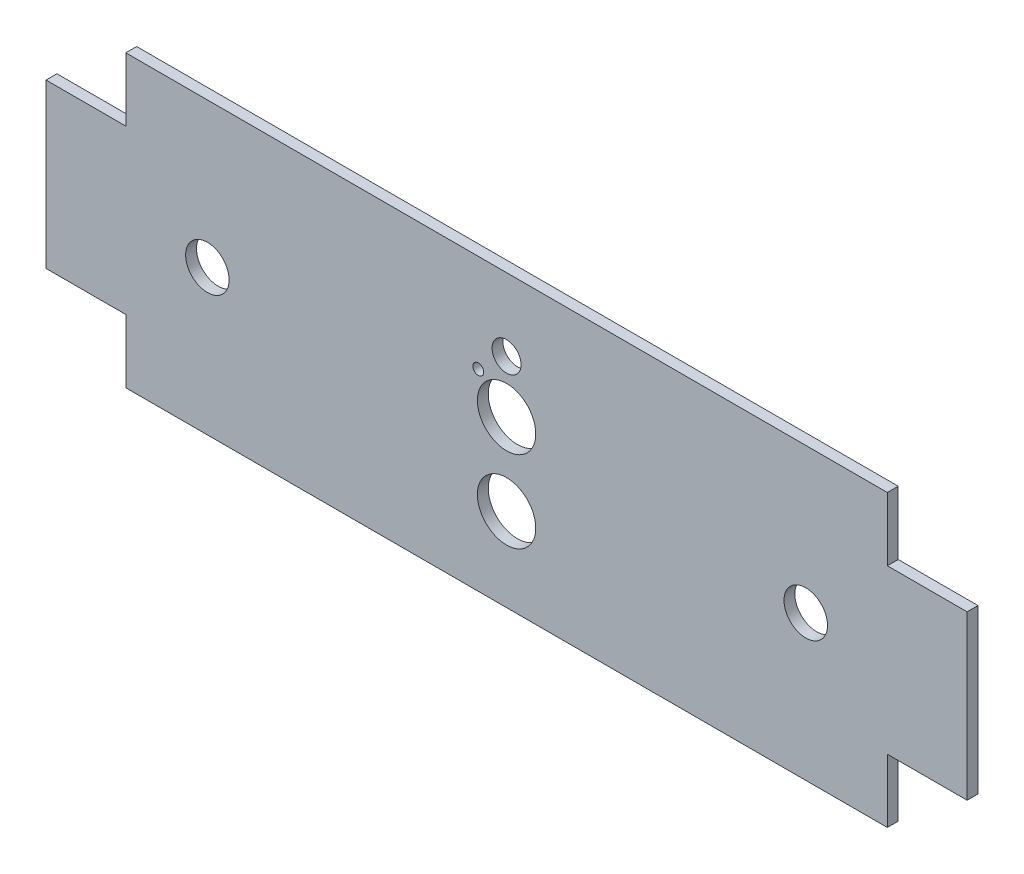
ISO-10303-21;
HEADER;
FILE_DESCRIPTION(('STEP AP214'),'2;1');
FILE_NAME('part.step','',(''),(''),'','','');
FILE_SCHEMA(('AUTOMOTIVE_DESIGN { 1 0 10303 214 1 1 1 1 }'));
ENDSEC;
DATA;
#1=APPLICATION_CONTEXT('core data for automotive mechanical design processes');
#2=APPLICATION_PROTOCOL_DEFINITION('international standard','automotive_design',2000,#1);
#3=PRODUCT_CONTEXT('',#1,'mechanical');
#4=PRODUCT('Part','Part','',(#3));
#5=PRODUCT_RELATED_PRODUCT_CATEGORY('part','',(#4));
#6=PRODUCT_DEFINITION_FORMATION('','',#4);
#7=PRODUCT_DEFINITION_CONTEXT('part definition',#1,'design');
#8=PRODUCT_DEFINITION('design','',#6,#7);
#9=PRODUCT_DEFINITION_SHAPE('','',#8);
#10=(LENGTH_UNIT() NAMED_UNIT(*) SI_UNIT(.MILLI.,.METRE.));
#11=(NAMED_UNIT(*) PLANE_ANGLE_UNIT() SI_UNIT($,.RADIAN.));
#12=(NAMED_UNIT(*) SI_UNIT($,.STERADIAN.) SOLID_ANGLE_UNIT());
#13=UNCERTAINTY_MEASURE_WITH_UNIT(LENGTH_MEASURE(1.E-05),#10,'distance_accuracy_value','');
#14=(GEOMETRIC_REPRESENTATION_CONTEXT(3) GLOBAL_UNCERTAINTY_ASSIGNED_CONTEXT((#13)) GLOBAL_UNIT_ASSIGNED_CONTEXT((#10,
#11,#12)) REPRESENTATION_CONTEXT('',''));
#15=CARTESIAN_POINT('',(0.,0.,0.));
#16=DIRECTION('',(0.,0.,1.));
#17=DIRECTION('',(1.,0.,0.));
#18=AXIS2_PLACEMENT_3D('',#15,#16,#17);
#19=CARTESIAN_POINT('',(-105.,-203.144327739373,3.));
#20=DIRECTION('',(-1.,0.,0.));
#21=DIRECTION('',(0.,0.,1.));
#22=AXIS2_PLACEMENT_3D('',#19,#20,#21);
#23=PLANE('',#22);
#24=DIRECTION('',(0.,1.,0.));
#25=VECTOR('',#24,1.);
#26=CARTESIAN_POINT('',(-105.,-203.144327739373,0.));
#27=LINE('',#26,#25);
#28=CARTESIAN_POINT('',(-105.,22.5,0.));
#29=VERTEX_POINT('',#28);
#30=CARTESIAN_POINT('',(-105.,40.,0.));
#31=VERTEX_POINT('',#30);
#32=EDGE_CURVE('E176',#29,#31,#27,.T.);
#33=ORIENTED_EDGE('',*,*,#32,.F.);
#34=DIRECTION('',(0.,0.,-1.));
#35=VECTOR('',#34,1.);
#36=CARTESIAN_POINT('',(-105.,22.5,3.));
#37=LINE('',#36,#35);
#38=CARTESIAN_POINT('',(-105.,22.5,3.));
#39=VERTEX_POINT('',#38);
#40=EDGE_CURVE('E189',#39,#29,#37,.T.);
#41=ORIENTED_EDGE('',*,*,#40,.F.);
#42=DIRECTION('',(0.,1.,0.));
#43=VECTOR('',#42,1.);
#44=CARTESIAN_POINT('',(-105.,-203.144327739373,3.));
#45=LINE('',#44,#43);
#46=CARTESIAN_POINT('',(-105.,40.,3.));
#47=VERTEX_POINT('',#46);
#48=EDGE_CURVE('E193',#39,#47,#45,.T.);
#49=ORIENTED_EDGE('',*,*,#48,.T.);
#50=DIRECTION('',(0.,0.,1.));
#51=VECTOR('',#50,1.);
#52=CARTESIAN_POINT('',(-105.,40.,-210.237960416286));
#53=LINE('',#52,#51);
#54=EDGE_CURVE('E302',#31,#47,#53,.T.);
#55=ORIENTED_EDGE('',*,*,#54,.F.);
#56=EDGE_LOOP('',(#33,#41,#49,#55));
#57=FACE_BOUND('',#56,.T.);
#58=ADVANCED_FACE('F69',(#57),#23,.T.);
#59=CARTESIAN_POINT('',(-105.,-40.,0.));
#60=VERTEX_POINT('',#59);
#61=CARTESIAN_POINT('',(-105.,-22.5,0.));
#62=VERTEX_POINT('',#61);
#63=EDGE_CURVE('E116',#60,#62,#27,.T.);
#64=ORIENTED_EDGE('',*,*,#63,.F.);
#65=DIRECTION('',(0.,0.,1.));
#66=VECTOR('',#65,1.);
#67=CARTESIAN_POINT('',(-105.,-40.,-210.237960416286));
#68=LINE('',#67,#66);
#69=CARTESIAN_POINT('',(-105.,-40.,3.));
#70=VERTEX_POINT('',#69);
#71=EDGE_CURVE('E264',#60,#70,#68,.T.);
#72=ORIENTED_EDGE('',*,*,#71,.T.);
#73=CARTESIAN_POINT('',(-105.,-22.5,3.));
#74=VERTEX_POINT('',#73);
#75=EDGE_CURVE('E217',#70,#74,#45,.T.);
#76=ORIENTED_EDGE('',*,*,#75,.T.);
#77=DIRECTION('',(0.,0.,-1.));
#78=VECTOR('',#77,1.);
#79=CARTESIAN_POINT('',(-105.,-22.5,3.));
#80=LINE('',#79,#78);
#81=EDGE_CURVE('E192',#74,#62,#80,.T.);
#82=ORIENTED_EDGE('',*,*,#81,.T.);
#83=EDGE_LOOP('',(#64,#72,#76,#82));
#84=FACE_BOUND('',#83,.T.);
#85=ADVANCED_FACE('F369',(#84),#23,.T.);
#86=CARTESIAN_POINT('',(0.,-22.5,3.));
#87=DIRECTION('',(0.,1.,0.));
#88=DIRECTION('',(0.,0.,1.));
#89=AXIS2_PLACEMENT_3D('',#86,#87,#88);
#90=PLANE('',#89);
#91=DIRECTION('',(1.,0.,0.));
#92=VECTOR('',#91,1.);
#93=CARTESIAN_POINT('',(0.,-22.5,0.));
#94=LINE('',#93,#92);
#95=CARTESIAN_POINT('',(-127.,-22.5,0.));
#96=VERTEX_POINT('',#95);
#97=EDGE_CURVE('E178',#96,#62,#94,.T.);
#98=ORIENTED_EDGE('',*,*,#97,.T.);
#99=ORIENTED_EDGE('',*,*,#81,.F.);
#100=DIRECTION('',(1.,0.,0.));
#101=VECTOR('',#100,1.);
#102=CARTESIAN_POINT('',(0.,-22.5,3.));
#103=LINE('',#102,#101);
#104=CARTESIAN_POINT('',(-127.,-22.5,3.));
#105=VERTEX_POINT('',#104);
#106=EDGE_CURVE('E291',#105,#74,#103,.T.);
#107=ORIENTED_EDGE('',*,*,#106,.F.);
#108=DIRECTION('',(0.,0.,-1.));
#109=VECTOR('',#108,1.);
#110=CARTESIAN_POINT('',(-127.,-22.5,3.));
#111=LINE('',#110,#109);
#112=EDGE_CURVE('E195',#105,#96,#111,.T.);
#113=ORIENTED_EDGE('',*,*,#112,.T.);
#114=EDGE_LOOP('',(#98,#99,#107,#113));
#115=FACE_BOUND('',#114,.T.);
#116=ADVANCED_FACE('F373',(#115),#90,.F.);
#117=CARTESIAN_POINT('',(-127.,-203.144327739373,3.));
#118=DIRECTION('',(-1.,0.,0.));
#119=DIRECTION('',(0.,0.,1.));
#120=AXIS2_PLACEMENT_3D('',#117,#118,#119);
#121=PLANE('',#120);
#122=DIRECTION('',(0.,1.,0.));
#123=VECTOR('',#122,1.);
#124=CARTESIAN_POINT('',(-127.,-203.144327739373,0.));
#125=LINE('',#124,#123);
#126=CARTESIAN_POINT('',(-127.,22.5,0.));
#127=VERTEX_POINT('',#126);
#128=EDGE_CURVE('E202',#96,#127,#125,.T.);
#129=ORIENTED_EDGE('',*,*,#128,.F.);
#130=ORIENTED_EDGE('',*,*,#112,.F.);
#131=DIRECTION('',(0.,1.,0.));
#132=VECTOR('',#131,1.);
#133=CARTESIAN_POINT('',(-127.,-203.144327739373,3.));
#134=LINE('',#133,#132);
#135=CARTESIAN_POINT('',(-127.,22.5,3.));
#136=VERTEX_POINT('',#135);
#137=EDGE_CURVE('E204',#105,#136,#134,.T.);
#138=ORIENTED_EDGE('',*,*,#137,.T.);
#139=DIRECTION('',(0.,0.,-1.));
#140=VECTOR('',#139,1.);
#141=CARTESIAN_POINT('',(-127.,22.5,3.));
#142=LINE('',#141,#140);
#143=EDGE_CURVE('E157',#136,#127,#142,.T.);
#144=ORIENTED_EDGE('',*,*,#143,.T.);
#145=EDGE_LOOP('',(#129,#130,#138,#144));
#146=FACE_BOUND('',#145,.T.);
#147=ADVANCED_FACE('F200',(#146),#121,.T.);
#148=CARTESIAN_POINT('',(0.,22.5,3.));
#149=DIRECTION('',(0.,1.,0.));
#150=DIRECTION('',(-1.,0.,0.));
#151=AXIS2_PLACEMENT_3D('',#148,#149,#150);
#152=PLANE('',#151);
#153=DIRECTION('',(1.,0.,0.));
#154=VECTOR('',#153,1.);
#155=CARTESIAN_POINT('',(0.,22.5,0.));
#156=LINE('',#155,#154);
#157=EDGE_CURVE('E208',#127,#29,#156,.T.);
#158=ORIENTED_EDGE('',*,*,#157,.F.);
#159=ORIENTED_EDGE('',*,*,#143,.F.);
#160=DIRECTION('',(1.,0.,0.));
#161=VECTOR('',#160,1.);
#162=CARTESIAN_POINT('',(0.,22.5,3.));
#163=LINE('',#162,#161);
#164=EDGE_CURVE('E289',#136,#39,#163,.T.);
#165=ORIENTED_EDGE('',*,*,#164,.T.);
#166=ORIENTED_EDGE('',*,*,#40,.T.);
#167=EDGE_LOOP('',(#158,#159,#165,#166));
#168=FACE_BOUND('',#167,.T.);
#169=ADVANCED_FACE('F209',(#168),#152,.T.);
#170=CARTESIAN_POINT('',(0.,-203.144327739373,0.));
#171=DIRECTION('',(0.,0.,1.));
#172=DIRECTION('',(1.,0.,0.));
#173=AXIS2_PLACEMENT_3D('',#170,#171,#172);
#174=PLANE('',#173);
#175=CARTESIAN_POINT('',(0.,-17.,0.));
#176=DIRECTION('',(0.,0.,1.));
#177=DIRECTION('',(1.,0.,0.));
#178=AXIS2_PLACEMENT_3D('',#175,#176,#177);
#179=CIRCLE('',#178,8.05);
#180=CARTESIAN_POINT('',(8.05,-17.,0.));
#181=VERTEX_POINT('',#180);
#182=EDGE_CURVE('E328',#181,#181,#179,.F.);
#183=ORIENTED_EDGE('',*,*,#182,.F.);
#184=EDGE_LOOP('',(#183));
#185=FACE_BOUND('',#184,.T.);
#186=CARTESIAN_POINT('',(0.,5.5,0.));
#187=DIRECTION('',(0.,0.,1.));
#188=DIRECTION('',(1.,0.,0.));
#189=AXIS2_PLACEMENT_3D('',#186,#187,#188);
#190=CIRCLE('',#189,8.05);
#191=CARTESIAN_POINT('',(8.05,5.5,0.));
#192=VERTEX_POINT('',#191);
#193=EDGE_CURVE('E322',#192,#192,#190,.F.);
#194=ORIENTED_EDGE('',*,*,#193,.F.);
#195=EDGE_LOOP('',(#194));
#196=FACE_BOUND('',#195,.T.);
#197=CARTESIAN_POINT('',(-7.8,13.05,0.));
#198=DIRECTION('',(0.,0.,1.));
#199=DIRECTION('',(1.,0.,0.));
#200=AXIS2_PLACEMENT_3D('',#197,#198,#199);
#201=CIRCLE('',#200,1.5);
#202=CARTESIAN_POINT('',(-6.3,13.05,0.));
#203=VERTEX_POINT('',#202);
#204=EDGE_CURVE('E312',#203,#203,#201,.F.);
#205=ORIENTED_EDGE('',*,*,#204,.F.);
#206=EDGE_LOOP('',(#205));
#207=FACE_BOUND('',#206,.T.);
#208=CARTESIAN_POINT('',(0.,20.,0.));
#209=DIRECTION('',(0.,0.,1.));
#210=DIRECTION('',(1.,0.,0.));
#211=AXIS2_PLACEMENT_3D('',#208,#209,#210);
#212=CIRCLE('',#211,4.);
#213=CARTESIAN_POINT('',(4.,20.,0.));
#214=VERTEX_POINT('',#213);
#215=EDGE_CURVE('E275',#214,#214,#212,.F.);
#216=ORIENTED_EDGE('',*,*,#215,.F.);
#217=EDGE_LOOP('',(#216));
#218=FACE_BOUND('',#217,.T.);
#219=CARTESIAN_POINT('',(-82.5,0.,0.));
#220=DIRECTION('',(0.,0.,1.));
#221=DIRECTION('',(1.,0.,0.));
#222=AXIS2_PLACEMENT_3D('',#219,#220,#221);
#223=CIRCLE('',#222,6.);
#224=CARTESIAN_POINT('',(-76.5,0.,0.));
#225=VERTEX_POINT('',#224);
#226=EDGE_CURVE('E281',#225,#225,#223,.F.);
#227=ORIENTED_EDGE('',*,*,#226,.F.);
#228=EDGE_LOOP('',(#227));
#229=FACE_BOUND('',#228,.T.);
#230=CARTESIAN_POINT('',(82.5,0.,0.));
#231=DIRECTION('',(0.,0.,1.));
#232=DIRECTION('',(1.,0.,0.));
#233=AXIS2_PLACEMENT_3D('',#230,#231,#232);
#234=CIRCLE('',#233,6.);
#235=CARTESIAN_POINT('',(88.5,0.,0.));
#236=VERTEX_POINT('',#235);
#237=EDGE_CURVE('E165',#236,#236,#234,.F.);
#238=ORIENTED_EDGE('',*,*,#237,.F.);
#239=EDGE_LOOP('',(#238));
#240=FACE_BOUND('',#239,.T.);
#241=ORIENTED_EDGE('',*,*,#157,.T.);
#242=ORIENTED_EDGE('',*,*,#32,.T.);
#243=DIRECTION('',(1.,0.,0.));
#244=VECTOR('',#243,1.);
#245=CARTESIAN_POINT('',(-105.,40.,0.));
#246=LINE('',#245,#244);
#247=CARTESIAN_POINT('',(105.,40.,0.));
#248=VERTEX_POINT('',#247);
#249=EDGE_CURVE('E171',#31,#248,#246,.T.);
#250=ORIENTED_EDGE('',*,*,#249,.T.);
#251=DIRECTION('',(0.,1.,0.));
#252=VECTOR('',#251,1.);
#253=CARTESIAN_POINT('',(105.,-203.144327739373,0.));
#254=LINE('',#253,#252);
#255=CARTESIAN_POINT('',(105.,22.5,0.));
#256=VERTEX_POINT('',#255);
#257=EDGE_CURVE('E153',#256,#248,#254,.T.);
#258=ORIENTED_EDGE('',*,*,#257,.F.);
#259=DIRECTION('',(-1.,0.,0.));
#260=VECTOR('',#259,1.);
#261=CARTESIAN_POINT('',(127.,22.5,0.));
#262=LINE('',#261,#260);
#263=CARTESIAN_POINT('',(127.,22.5,0.));
#264=VERTEX_POINT('',#263);
#265=EDGE_CURVE('E160',#264,#256,#262,.T.);
#266=ORIENTED_EDGE('',*,*,#265,.F.);
#267=DIRECTION('',(0.,-1.,0.));
#268=VECTOR('',#267,1.);
#269=CARTESIAN_POINT('',(127.,22.5,0.));
#270=LINE('',#269,#268);
#271=CARTESIAN_POINT('',(127.,-22.5,0.));
#272=VERTEX_POINT('',#271);
#273=EDGE_CURVE('E230',#264,#272,#270,.T.);
#274=ORIENTED_EDGE('',*,*,#273,.T.);
#275=DIRECTION('',(-1.,0.,0.));
#276=VECTOR('',#275,1.);
#277=CARTESIAN_POINT('',(127.,-22.5,0.));
#278=LINE('',#277,#276);
#279=CARTESIAN_POINT('',(105.,-22.5,0.));
#280=VERTEX_POINT('',#279);
#281=EDGE_CURVE('E164',#272,#280,#278,.T.);
#282=ORIENTED_EDGE('',*,*,#281,.T.);
#283=CARTESIAN_POINT('',(105.,-40.,0.));
#284=VERTEX_POINT('',#283);
#285=EDGE_CURVE('E173',#284,#280,#254,.T.);
#286=ORIENTED_EDGE('',*,*,#285,.F.);
#287=DIRECTION('',(-1.,0.,0.));
#288=VECTOR('',#287,1.);
#289=CARTESIAN_POINT('',(-105.,-40.,0.));
#290=LINE('',#289,#288);
#291=EDGE_CURVE('E258',#284,#60,#290,.T.);
#292=ORIENTED_EDGE('',*,*,#291,.T.);
#293=ORIENTED_EDGE('',*,*,#63,.T.);
#294=ORIENTED_EDGE('',*,*,#97,.F.);
#295=ORIENTED_EDGE('',*,*,#128,.T.);
#296=EDGE_LOOP('',(#241,#242,#250,#258,#266,#274,#282,#286,#292,#293,#294,#295));
#297=FACE_BOUND('',#296,.T.);
#298=ADVANCED_FACE('F168',(#185,#196,#207,#218,#229,#240,#297),#174,.F.);
#299=CARTESIAN_POINT('',(0.,-203.144327739373,3.));
#300=DIRECTION('',(0.,0.,1.));
#301=DIRECTION('',(1.,0.,0.));
#302=AXIS2_PLACEMENT_3D('',#299,#300,#301);
#303=PLANE('',#302);
#304=CARTESIAN_POINT('',(0.,-17.,3.));
#305=DIRECTION('',(0.,0.,1.));
#306=DIRECTION('',(1.,0.,0.));
#307=AXIS2_PLACEMENT_3D('',#304,#305,#306);
#308=CIRCLE('',#307,8.05);
#309=CARTESIAN_POINT('',(8.05,-17.,3.));
#310=VERTEX_POINT('',#309);
#311=EDGE_CURVE('E331',#310,#310,#308,.T.);
#312=ORIENTED_EDGE('',*,*,#311,.F.);
#313=EDGE_LOOP('',(#312));
#314=FACE_BOUND('',#313,.T.);
#315=CARTESIAN_POINT('',(0.,5.5,3.));
#316=DIRECTION('',(0.,0.,1.));
#317=DIRECTION('',(1.,0.,0.));
#318=AXIS2_PLACEMENT_3D('',#315,#316,#317);
#319=CIRCLE('',#318,8.05);
#320=CARTESIAN_POINT('',(8.05,5.5,3.));
#321=VERTEX_POINT('',#320);
#322=EDGE_CURVE('E325',#321,#321,#319,.T.);
#323=ORIENTED_EDGE('',*,*,#322,.F.);
#324=EDGE_LOOP('',(#323));
#325=FACE_BOUND('',#324,.T.);
#326=CARTESIAN_POINT('',(-7.8,13.05,3.));
#327=DIRECTION('',(0.,0.,1.));
#328=DIRECTION('',(1.,0.,0.));
#329=AXIS2_PLACEMENT_3D('',#326,#327,#328);
#330=CIRCLE('',#329,1.5);
#331=CARTESIAN_POINT('',(-6.3,13.05,3.));
#332=VERTEX_POINT('',#331);
#333=EDGE_CURVE('E316',#332,#332,#330,.T.);
#334=ORIENTED_EDGE('',*,*,#333,.F.);
#335=EDGE_LOOP('',(#334));
#336=FACE_BOUND('',#335,.T.);
#337=CARTESIAN_POINT('',(0.,20.,3.));
#338=DIRECTION('',(0.,0.,1.));
#339=DIRECTION('',(1.,0.,0.));
#340=AXIS2_PLACEMENT_3D('',#337,#338,#339);
#341=CIRCLE('',#340,4.);
#342=CARTESIAN_POINT('',(4.,20.,3.));
#343=VERTEX_POINT('',#342);
#344=EDGE_CURVE('E261',#343,#343,#341,.T.);
#345=ORIENTED_EDGE('',*,*,#344,.F.);
#346=EDGE_LOOP('',(#345));
#347=FACE_BOUND('',#346,.T.);
#348=CARTESIAN_POINT('',(-82.5,0.,3.));
#349=DIRECTION('',(0.,0.,1.));
#350=DIRECTION('',(1.,0.,0.));
#351=AXIS2_PLACEMENT_3D('',#348,#349,#350);
#352=CIRCLE('',#351,6.);
#353=CARTESIAN_POINT('',(-76.5,0.,3.));
#354=VERTEX_POINT('',#353);
#355=EDGE_CURVE('E278',#354,#354,#352,.T.);
#356=ORIENTED_EDGE('',*,*,#355,.F.);
#357=EDGE_LOOP('',(#356));
#358=FACE_BOUND('',#357,.T.);
#359=CARTESIAN_POINT('',(82.5,0.,3.));
#360=DIRECTION('',(0.,0.,1.));
#361=DIRECTION('',(1.,0.,0.));
#362=AXIS2_PLACEMENT_3D('',#359,#360,#361);
#363=CIRCLE('',#362,6.);
#364=CARTESIAN_POINT('',(88.5,0.,3.));
#365=VERTEX_POINT('',#364);
#366=EDGE_CURVE('E284',#365,#365,#363,.T.);
#367=ORIENTED_EDGE('',*,*,#366,.F.);
#368=EDGE_LOOP('',(#367));
#369=FACE_BOUND('',#368,.T.);
#370=ORIENTED_EDGE('',*,*,#164,.F.);
#371=ORIENTED_EDGE('',*,*,#137,.F.);
#372=ORIENTED_EDGE('',*,*,#106,.T.);
#373=ORIENTED_EDGE('',*,*,#75,.F.);
#374=DIRECTION('',(1.,0.,0.));
#375=VECTOR('',#374,1.);
#376=CARTESIAN_POINT('',(-105.,-40.,3.));
#377=LINE('',#376,#375);
#378=CARTESIAN_POINT('',(105.,-40.,3.));
#379=VERTEX_POINT('',#378);
#380=EDGE_CURVE('E267',#70,#379,#377,.T.);
#381=ORIENTED_EDGE('',*,*,#380,.T.);
#382=DIRECTION('',(0.,1.,0.));
#383=VECTOR('',#382,1.);
#384=CARTESIAN_POINT('',(105.,-203.144327739373,3.));
#385=LINE('',#384,#383);
#386=CARTESIAN_POINT('',(105.,-22.5,3.));
#387=VERTEX_POINT('',#386);
#388=EDGE_CURVE('E183',#379,#387,#385,.T.);
#389=ORIENTED_EDGE('',*,*,#388,.T.);
#390=DIRECTION('',(-1.,0.,0.));
#391=VECTOR('',#390,1.);
#392=CARTESIAN_POINT('',(127.,-22.5,3.));
#393=LINE('',#392,#391);
#394=CARTESIAN_POINT('',(127.,-22.5,3.));
#395=VERTEX_POINT('',#394);
#396=EDGE_CURVE('E229',#395,#387,#393,.T.);
#397=ORIENTED_EDGE('',*,*,#396,.F.);
#398=DIRECTION('',(0.,-1.,0.));
#399=VECTOR('',#398,1.);
#400=CARTESIAN_POINT('',(127.,22.5,3.));
#401=LINE('',#400,#399);
#402=CARTESIAN_POINT('',(127.,22.5,3.));
#403=VERTEX_POINT('',#402);
#404=EDGE_CURVE('E237',#403,#395,#401,.T.);
#405=ORIENTED_EDGE('',*,*,#404,.F.);
#406=DIRECTION('',(-1.,0.,0.));
#407=VECTOR('',#406,1.);
#408=CARTESIAN_POINT('',(127.,22.5,3.));
#409=LINE('',#408,#407);
#410=CARTESIAN_POINT('',(105.,22.5,3.));
#411=VERTEX_POINT('',#410);
#412=EDGE_CURVE('E227',#403,#411,#409,.T.);
#413=ORIENTED_EDGE('',*,*,#412,.T.);
#414=CARTESIAN_POINT('',(105.,40.,3.));
#415=VERTEX_POINT('',#414);
#416=EDGE_CURVE('E156',#411,#415,#385,.T.);
#417=ORIENTED_EDGE('',*,*,#416,.T.);
#418=DIRECTION('',(-1.,0.,0.));
#419=VECTOR('',#418,1.);
#420=CARTESIAN_POINT('',(-105.,40.,3.));
#421=LINE('',#420,#419);
#422=EDGE_CURVE('E309',#415,#47,#421,.T.);
#423=ORIENTED_EDGE('',*,*,#422,.T.);
#424=ORIENTED_EDGE('',*,*,#48,.F.);
#425=EDGE_LOOP('',(#370,#371,#372,#373,#381,#389,#397,#405,#413,#417,#423,#424));
#426=FACE_BOUND('',#425,.T.);
#427=ADVANCED_FACE('F246',(#314,#325,#336,#347,#358,#369,#426),#303,.T.);
#428=CARTESIAN_POINT('',(105.,-203.144327739373,3.));
#429=DIRECTION('',(-1.,0.,0.));
#430=DIRECTION('',(0.,0.,1.));
#431=AXIS2_PLACEMENT_3D('',#428,#429,#430);
#432=PLANE('',#431);
#433=ORIENTED_EDGE('',*,*,#416,.F.);
#434=DIRECTION('',(0.,0.,-1.));
#435=VECTOR('',#434,1.);
#436=CARTESIAN_POINT('',(105.,22.5,3.));
#437=LINE('',#436,#435);
#438=EDGE_CURVE('E79',#411,#256,#437,.T.);
#439=ORIENTED_EDGE('',*,*,#438,.T.);
#440=ORIENTED_EDGE('',*,*,#257,.T.);
#441=DIRECTION('',(0.,0.,1.));
#442=VECTOR('',#441,1.);
#443=CARTESIAN_POINT('',(105.,40.,-210.237960416286));
#444=LINE('',#443,#442);
#445=EDGE_CURVE('E310',#248,#415,#444,.T.);
#446=ORIENTED_EDGE('',*,*,#445,.T.);
#447=EDGE_LOOP('',(#433,#439,#440,#446));
#448=FACE_BOUND('',#447,.T.);
#449=ADVANCED_FACE('F149',(#448),#432,.F.);
#450=DIRECTION('',(0.,0.,-1.));
#451=VECTOR('',#450,1.);
#452=CARTESIAN_POINT('',(105.,-22.5,3.));
#453=LINE('',#452,#451);
#454=EDGE_CURVE('E12',#387,#280,#453,.T.);
#455=ORIENTED_EDGE('',*,*,#454,.F.);
#456=ORIENTED_EDGE('',*,*,#388,.F.);
#457=DIRECTION('',(0.,0.,1.));
#458=VECTOR('',#457,1.);
#459=CARTESIAN_POINT('',(105.,-40.,-210.237960416286));
#460=LINE('',#459,#458);
#461=EDGE_CURVE('E256',#284,#379,#460,.T.);
#462=ORIENTED_EDGE('',*,*,#461,.F.);
#463=ORIENTED_EDGE('',*,*,#285,.T.);
#464=EDGE_LOOP('',(#455,#456,#462,#463));
#465=FACE_BOUND('',#464,.T.);
#466=ADVANCED_FACE('F253',(#465),#432,.F.);
#467=CARTESIAN_POINT('',(127.,22.5,3.));
#468=DIRECTION('',(1.,0.,0.));
#469=DIRECTION('',(0.,0.,-1.));
#470=AXIS2_PLACEMENT_3D('',#467,#468,#469);
#471=PLANE('',#470);
#472=ORIENTED_EDGE('',*,*,#273,.F.);
#473=DIRECTION('',(0.,0.,-1.));
#474=VECTOR('',#473,1.);
#475=CARTESIAN_POINT('',(127.,22.5,3.));
#476=LINE('',#475,#474);
#477=EDGE_CURVE('E161',#403,#264,#476,.T.);
#478=ORIENTED_EDGE('',*,*,#477,.F.);
#479=ORIENTED_EDGE('',*,*,#404,.T.);
#480=DIRECTION('',(0.,0.,-1.));
#481=VECTOR('',#480,1.);
#482=CARTESIAN_POINT('',(127.,-22.5,3.));
#483=LINE('',#482,#481);
#484=EDGE_CURVE('E106',#395,#272,#483,.T.);
#485=ORIENTED_EDGE('',*,*,#484,.T.);
#486=EDGE_LOOP('',(#472,#478,#479,#485));
#487=FACE_BOUND('',#486,.T.);
#488=ADVANCED_FACE('F243',(#487),#471,.T.);
#489=CARTESIAN_POINT('',(127.,22.5,3.));
#490=DIRECTION('',(0.,-1.,0.));
#491=DIRECTION('',(1.,0.,0.));
#492=AXIS2_PLACEMENT_3D('',#489,#490,#491);
#493=PLANE('',#492);
#494=ORIENTED_EDGE('',*,*,#265,.T.);
#495=ORIENTED_EDGE('',*,*,#438,.F.);
#496=ORIENTED_EDGE('',*,*,#412,.F.);
#497=ORIENTED_EDGE('',*,*,#477,.T.);
#498=EDGE_LOOP('',(#494,#495,#496,#497));
#499=FACE_BOUND('',#498,.T.);
#500=ADVANCED_FACE('F71',(#499),#493,.F.);
#501=CARTESIAN_POINT('',(127.,-22.5,3.));
#502=DIRECTION('',(0.,-1.,0.));
#503=DIRECTION('',(0.,0.,-1.));
#504=AXIS2_PLACEMENT_3D('',#501,#502,#503);
#505=PLANE('',#504);
#506=ORIENTED_EDGE('',*,*,#281,.F.);
#507=ORIENTED_EDGE('',*,*,#484,.F.);
#508=ORIENTED_EDGE('',*,*,#396,.T.);
#509=ORIENTED_EDGE('',*,*,#454,.T.);
#510=EDGE_LOOP('',(#506,#507,#508,#509));
#511=FACE_BOUND('',#510,.T.);
#512=ADVANCED_FACE('F251',(#511),#505,.T.);
#513=CARTESIAN_POINT('',(82.5,0.,-0.00104999999999984));
#514=DIRECTION('',(0.,0.,1.));
#515=DIRECTION('',(1.,0.,0.));
#516=AXIS2_PLACEMENT_3D('',#513,#514,#515);
#517=CYLINDRICAL_SURFACE('',#516,6.);
#518=ORIENTED_EDGE('',*,*,#366,.T.);
#519=EDGE_LOOP('',(#518));
#520=FACE_BOUND('',#519,.T.);
#521=ORIENTED_EDGE('',*,*,#237,.T.);
#522=EDGE_LOOP('',(#521));
#523=FACE_BOUND('',#522,.T.);
#524=ADVANCED_FACE('F351',(#520,#523),#517,.F.);
#525=CARTESIAN_POINT('',(-82.5,0.,-0.00104999999999984));
#526=DIRECTION('',(0.,0.,1.));
#527=DIRECTION('',(1.,0.,0.));
#528=AXIS2_PLACEMENT_3D('',#525,#526,#527);
#529=CYLINDRICAL_SURFACE('',#528,6.);
#530=ORIENTED_EDGE('',*,*,#355,.T.);
#531=EDGE_LOOP('',(#530));
#532=FACE_BOUND('',#531,.T.);
#533=ORIENTED_EDGE('',*,*,#226,.T.);
#534=EDGE_LOOP('',(#533));
#535=FACE_BOUND('',#534,.T.);
#536=ADVANCED_FACE('F354',(#532,#535),#529,.F.);
#537=CARTESIAN_POINT('',(0.,20.,-0.00104999999999984));
#538=DIRECTION('',(0.,0.,1.));
#539=DIRECTION('',(1.,0.,0.));
#540=AXIS2_PLACEMENT_3D('',#537,#538,#539);
#541=CYLINDRICAL_SURFACE('',#540,4.);
#542=ORIENTED_EDGE('',*,*,#344,.T.);
#543=EDGE_LOOP('',(#542));
#544=FACE_BOUND('',#543,.T.);
#545=ORIENTED_EDGE('',*,*,#215,.T.);
#546=EDGE_LOOP('',(#545));
#547=FACE_BOUND('',#546,.T.);
#548=ADVANCED_FACE('F428',(#544,#547),#541,.F.);
#549=CARTESIAN_POINT('',(-105.,-40.,-210.237960416286));
#550=DIRECTION('',(0.,-1.,0.));
#551=DIRECTION('',(0.,0.,-1.));
#552=AXIS2_PLACEMENT_3D('',#549,#550,#551);
#553=PLANE('',#552);
#554=ORIENTED_EDGE('',*,*,#291,.F.);
#555=ORIENTED_EDGE('',*,*,#461,.T.);
#556=ORIENTED_EDGE('',*,*,#380,.F.);
#557=ORIENTED_EDGE('',*,*,#71,.F.);
#558=EDGE_LOOP('',(#554,#555,#556,#557));
#559=FACE_BOUND('',#558,.T.);
#560=ADVANCED_FACE('F265',(#559),#553,.T.);
#561=CARTESIAN_POINT('',(-105.,40.,-210.237960416286));
#562=DIRECTION('',(0.,1.,0.));
#563=DIRECTION('',(0.,0.,1.));
#564=AXIS2_PLACEMENT_3D('',#561,#562,#563);
#565=PLANE('',#564);
#566=ORIENTED_EDGE('',*,*,#249,.F.);
#567=ORIENTED_EDGE('',*,*,#54,.T.);
#568=ORIENTED_EDGE('',*,*,#422,.F.);
#569=ORIENTED_EDGE('',*,*,#445,.F.);
#570=EDGE_LOOP('',(#566,#567,#568,#569));
#571=FACE_BOUND('',#570,.T.);
#572=ADVANCED_FACE('F308',(#571),#565,.T.);
#573=CARTESIAN_POINT('',(-7.8,13.05,-0.00104999999999984));
#574=DIRECTION('',(0.,0.,1.));
#575=DIRECTION('',(1.,0.,0.));
#576=AXIS2_PLACEMENT_3D('',#573,#574,#575);
#577=CYLINDRICAL_SURFACE('',#576,1.5);
#578=ORIENTED_EDGE('',*,*,#333,.T.);
#579=EDGE_LOOP('',(#578));
#580=FACE_BOUND('',#579,.T.);
#581=ORIENTED_EDGE('',*,*,#204,.T.);
#582=EDGE_LOOP('',(#581));
#583=FACE_BOUND('',#582,.T.);
#584=ADVANCED_FACE('F524',(#580,#583),#577,.F.);
#585=CARTESIAN_POINT('',(0.,5.5,-0.00104999999999984));
#586=DIRECTION('',(0.,0.,1.));
#587=DIRECTION('',(1.,0.,0.));
#588=AXIS2_PLACEMENT_3D('',#585,#586,#587);
#589=CYLINDRICAL_SURFACE('',#588,8.05);
#590=ORIENTED_EDGE('',*,*,#322,.T.);
#591=EDGE_LOOP('',(#590));
#592=FACE_BOUND('',#591,.T.);
#593=ORIENTED_EDGE('',*,*,#193,.T.);
#594=EDGE_LOOP('',(#593));
#595=FACE_BOUND('',#594,.T.);
#596=ADVANCED_FACE('F529',(#592,#595),#589,.F.);
#597=CARTESIAN_POINT('',(0.,-17.,-0.00104999999999984));
#598=DIRECTION('',(0.,0.,1.));
#599=DIRECTION('',(1.,0.,0.));
#600=AXIS2_PLACEMENT_3D('',#597,#598,#599);
#601=CYLINDRICAL_SURFACE('',#600,8.05);
#602=ORIENTED_EDGE('',*,*,#311,.T.);
#603=EDGE_LOOP('',(#602));
#604=FACE_BOUND('',#603,.T.);
#605=ORIENTED_EDGE('',*,*,#182,.T.);
#606=EDGE_LOOP('',(#605));
#607=FACE_BOUND('',#606,.T.);
#608=ADVANCED_FACE('F335',(#604,#607),#601,.F.);
#609=CLOSED_SHELL('',(#58,#85,#116,#147,#169,#298,#427,#449,#466,#488,#500,#512,#524,#536,#548,
#560,#572,#584,#596,#608));
#610=MANIFOLD_SOLID_BREP('B2',#609);
#611=ADVANCED_BREP_SHAPE_REPRESENTATION('',(#18,#610),#14);
#612=SHAPE_DEFINITION_REPRESENTATION(#9,#611);
ENDSEC;
END-ISO-10303-21;
